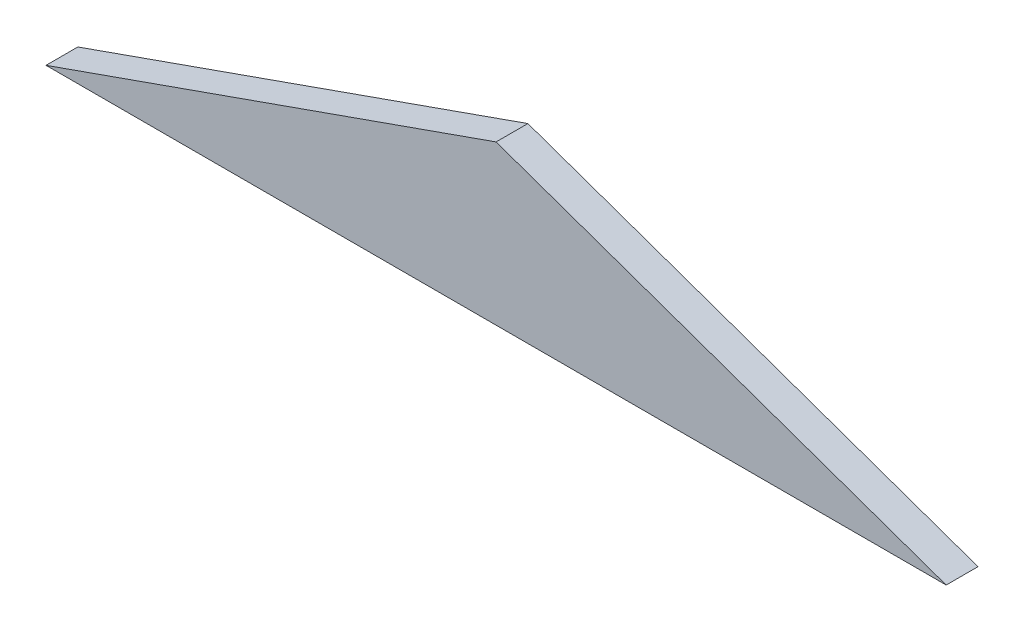
ISO-10303-21;
HEADER;
FILE_DESCRIPTION(('STEP AP214'),'2;1');
FILE_NAME('part.step','',(''),(''),'','','');
FILE_SCHEMA(('AUTOMOTIVE_DESIGN { 1 0 10303 214 1 1 1 1 }'));
ENDSEC;
DATA;
#1=APPLICATION_CONTEXT('core data for automotive mechanical design processes');
#2=APPLICATION_PROTOCOL_DEFINITION('international standard','automotive_design',2000,#1);
#3=PRODUCT_CONTEXT('',#1,'mechanical');
#4=PRODUCT('Part','Part','',(#3));
#5=PRODUCT_RELATED_PRODUCT_CATEGORY('part','',(#4));
#6=PRODUCT_DEFINITION_FORMATION('','',#4);
#7=PRODUCT_DEFINITION_CONTEXT('part definition',#1,'design');
#8=PRODUCT_DEFINITION('design','',#6,#7);
#9=PRODUCT_DEFINITION_SHAPE('','',#8);
#10=(LENGTH_UNIT() NAMED_UNIT(*) SI_UNIT(.MILLI.,.METRE.));
#11=(NAMED_UNIT(*) PLANE_ANGLE_UNIT() SI_UNIT($,.RADIAN.));
#12=(NAMED_UNIT(*) SI_UNIT($,.STERADIAN.) SOLID_ANGLE_UNIT());
#13=UNCERTAINTY_MEASURE_WITH_UNIT(LENGTH_MEASURE(1.E-05),#10,'distance_accuracy_value','');
#14=(GEOMETRIC_REPRESENTATION_CONTEXT(3) GLOBAL_UNCERTAINTY_ASSIGNED_CONTEXT((#13)) GLOBAL_UNIT_ASSIGNED_CONTEXT((#10,
#11,#12)) REPRESENTATION_CONTEXT('',''));
#15=CARTESIAN_POINT('',(0.,0.,0.));
#16=DIRECTION('',(0.,0.,1.));
#17=DIRECTION('',(1.,0.,0.));
#18=AXIS2_PLACEMENT_3D('',#15,#16,#17);
#19=CARTESIAN_POINT('',(-42.438622075159,95.0345946810041,3.));
#20=DIRECTION('',(0.332564562644353,-0.943080490559088,0.));
#21=DIRECTION('',(0.943080490559088,0.332564562644353,0.));
#22=AXIS2_PLACEMENT_3D('',#19,#20,#21);
#23=PLANE('',#22);
#24=DIRECTION('',(-0.943080490559088,-0.332564562644353,0.));
#25=VECTOR('',#24,1.);
#26=CARTESIAN_POINT('',(-42.438622075159,95.0345946810041,0.));
#27=LINE('',#26,#25);
#28=CARTESIAN_POINT('',(0.,110.,0.));
#29=VERTEX_POINT('',#28);
#30=CARTESIAN_POINT('',(-42.438622075159,95.0345946810041,0.));
#31=VERTEX_POINT('',#30);
#32=EDGE_CURVE('E80',#29,#31,#27,.T.);
#33=ORIENTED_EDGE('',*,*,#32,.T.);
#34=DIRECTION('',(0.,0.,-1.));
#35=VECTOR('',#34,1.);
#36=CARTESIAN_POINT('',(-42.438622075159,95.0345946810041,3.));
#37=LINE('',#36,#35);
#38=CARTESIAN_POINT('',(-42.438622075159,95.0345946810041,3.));
#39=VERTEX_POINT('',#38);
#40=EDGE_CURVE('E11',#39,#31,#37,.T.);
#41=ORIENTED_EDGE('',*,*,#40,.F.);
#42=DIRECTION('',(-0.943080490559088,-0.332564562644353,0.));
#43=VECTOR('',#42,1.);
#44=CARTESIAN_POINT('',(-42.438622075159,95.0345946810041,3.));
#45=LINE('',#44,#43);
#46=CARTESIAN_POINT('',(0.,110.,3.));
#47=VERTEX_POINT('',#46);
#48=EDGE_CURVE('E73',#47,#39,#45,.T.);
#49=ORIENTED_EDGE('',*,*,#48,.F.);
#50=DIRECTION('',(0.,0.,-1.));
#51=VECTOR('',#50,1.);
#52=CARTESIAN_POINT('',(0.,110.,3.));
#53=LINE('',#52,#51);
#54=EDGE_CURVE('E81',#47,#29,#53,.T.);
#55=ORIENTED_EDGE('',*,*,#54,.T.);
#56=EDGE_LOOP('',(#33,#41,#49,#55));
#57=FACE_BOUND('',#56,.T.);
#58=ADVANCED_FACE('F33',(#57),#23,.F.);
#59=CARTESIAN_POINT('',(42.438622075159,95.0345946810041,3.));
#60=DIRECTION('',(0.,1.,0.));
#61=DIRECTION('',(-1.,0.,0.));
#62=AXIS2_PLACEMENT_3D('',#59,#60,#61);
#63=PLANE('',#62);
#64=DIRECTION('',(1.,0.,0.));
#65=VECTOR('',#64,1.);
#66=CARTESIAN_POINT('',(42.438622075159,95.0345946810041,0.));
#67=LINE('',#66,#65);
#68=CARTESIAN_POINT('',(42.438622075159,95.0345946810041,0.));
#69=VERTEX_POINT('',#68);
#70=EDGE_CURVE('E61',#31,#69,#67,.T.);
#71=ORIENTED_EDGE('',*,*,#70,.T.);
#72=DIRECTION('',(0.,0.,-1.));
#73=VECTOR('',#72,1.);
#74=CARTESIAN_POINT('',(42.438622075159,95.0345946810041,3.));
#75=LINE('',#74,#73);
#76=CARTESIAN_POINT('',(42.438622075159,95.0345946810041,3.));
#77=VERTEX_POINT('',#76);
#78=EDGE_CURVE('E41',#77,#69,#75,.T.);
#79=ORIENTED_EDGE('',*,*,#78,.F.);
#80=DIRECTION('',(1.,0.,0.));
#81=VECTOR('',#80,1.);
#82=CARTESIAN_POINT('',(42.438622075159,95.0345946810041,3.));
#83=LINE('',#82,#81);
#84=EDGE_CURVE('E69',#39,#77,#83,.T.);
#85=ORIENTED_EDGE('',*,*,#84,.F.);
#86=ORIENTED_EDGE('',*,*,#40,.T.);
#87=EDGE_LOOP('',(#71,#79,#85,#86));
#88=FACE_BOUND('',#87,.T.);
#89=ADVANCED_FACE('F70',(#88),#63,.F.);
#90=CARTESIAN_POINT('',(42.438622075159,95.0345946810041,3.));
#91=DIRECTION('',(-0.332564562644353,-0.943080490559088,0.));
#92=DIRECTION('',(0.943080490559088,-0.332564562644353,0.));
#93=AXIS2_PLACEMENT_3D('',#90,#91,#92);
#94=PLANE('',#93);
#95=DIRECTION('',(-0.943080490559088,0.332564562644353,0.));
#96=VECTOR('',#95,1.);
#97=CARTESIAN_POINT('',(42.438622075159,95.0345946810041,0.));
#98=LINE('',#97,#96);
#99=EDGE_CURVE('E66',#69,#29,#98,.T.);
#100=ORIENTED_EDGE('',*,*,#99,.T.);
#101=ORIENTED_EDGE('',*,*,#54,.F.);
#102=DIRECTION('',(-0.943080490559088,0.332564562644353,0.));
#103=VECTOR('',#102,1.);
#104=CARTESIAN_POINT('',(42.438622075159,95.0345946810041,3.));
#105=LINE('',#104,#103);
#106=EDGE_CURVE('E49',#77,#47,#105,.T.);
#107=ORIENTED_EDGE('',*,*,#106,.F.);
#108=ORIENTED_EDGE('',*,*,#78,.T.);
#109=EDGE_LOOP('',(#100,#101,#107,#108));
#110=FACE_BOUND('',#109,.T.);
#111=ADVANCED_FACE('F88',(#110),#94,.F.);
#112=CARTESIAN_POINT('',(0.,0.,3.));
#113=DIRECTION('',(0.,0.,1.));
#114=DIRECTION('',(1.,0.,0.));
#115=AXIS2_PLACEMENT_3D('',#112,#113,#114);
#116=PLANE('',#115);
#117=ORIENTED_EDGE('',*,*,#48,.T.);
#118=ORIENTED_EDGE('',*,*,#84,.T.);
#119=ORIENTED_EDGE('',*,*,#106,.T.);
#120=EDGE_LOOP('',(#117,#118,#119));
#121=FACE_BOUND('',#120,.T.);
#122=ADVANCED_FACE('F76',(#121),#116,.T.);
#123=CARTESIAN_POINT('',(0.,0.,0.));
#124=DIRECTION('',(0.,0.,1.));
#125=DIRECTION('',(1.,0.,0.));
#126=AXIS2_PLACEMENT_3D('',#123,#124,#125);
#127=PLANE('',#126);
#128=ORIENTED_EDGE('',*,*,#32,.F.);
#129=ORIENTED_EDGE('',*,*,#99,.F.);
#130=ORIENTED_EDGE('',*,*,#70,.F.);
#131=EDGE_LOOP('',(#128,#129,#130));
#132=FACE_BOUND('',#131,.T.);
#133=ADVANCED_FACE('F89',(#132),#127,.F.);
#134=CLOSED_SHELL('',(#58,#89,#111,#122,#133));
#135=MANIFOLD_SOLID_BREP('B2',#134);
#136=ADVANCED_BREP_SHAPE_REPRESENTATION('',(#18,#135),#14);
#137=SHAPE_DEFINITION_REPRESENTATION(#9,#136);
ENDSEC;
END-ISO-10303-21;
